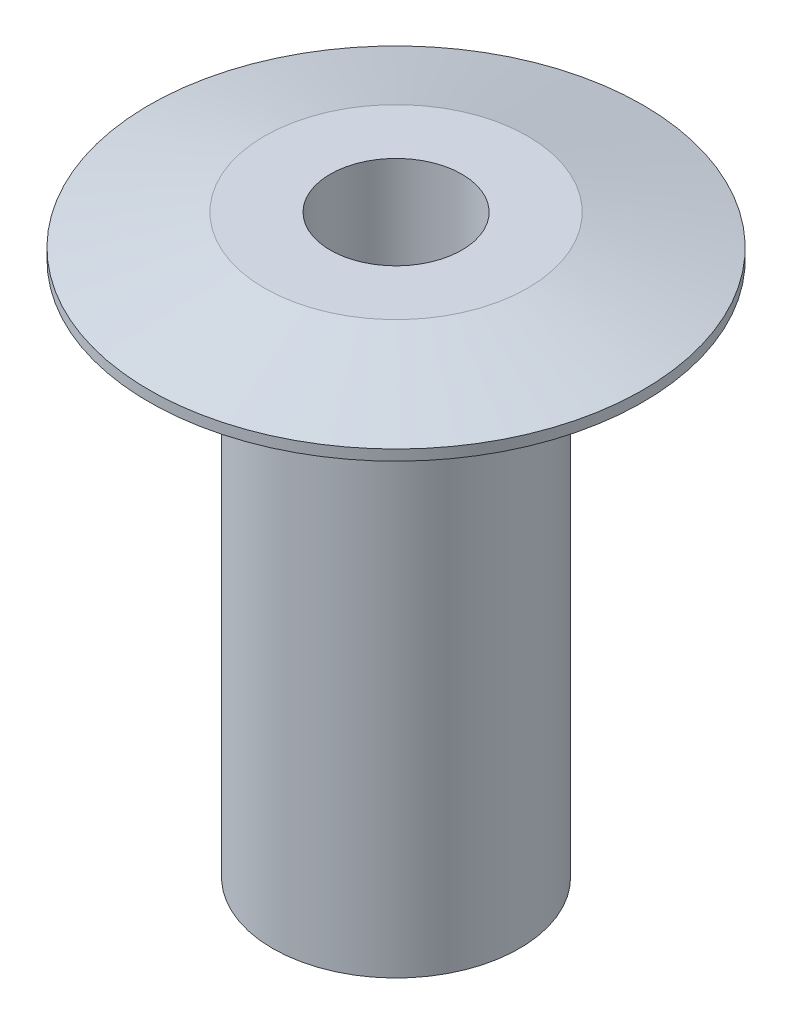
ISO-10303-21;
HEADER;
FILE_DESCRIPTION(('STEP AP214'),'2;1');
FILE_NAME('part.step','',(''),(''),'','','');
FILE_SCHEMA(('AUTOMOTIVE_DESIGN { 1 0 10303 214 1 1 1 1 }'));
ENDSEC;
DATA;
#1=APPLICATION_CONTEXT('core data for automotive mechanical design processes');
#2=APPLICATION_PROTOCOL_DEFINITION('international standard','automotive_design',2000,#1);
#3=PRODUCT_CONTEXT('',#1,'mechanical');
#4=PRODUCT('Part','Part','',(#3));
#5=PRODUCT_RELATED_PRODUCT_CATEGORY('part','',(#4));
#6=PRODUCT_DEFINITION_FORMATION('','',#4);
#7=PRODUCT_DEFINITION_CONTEXT('part definition',#1,'design');
#8=PRODUCT_DEFINITION('design','',#6,#7);
#9=PRODUCT_DEFINITION_SHAPE('','',#8);
#10=(LENGTH_UNIT() NAMED_UNIT(*) SI_UNIT(.MILLI.,.METRE.));
#11=(NAMED_UNIT(*) PLANE_ANGLE_UNIT() SI_UNIT($,.RADIAN.));
#12=(NAMED_UNIT(*) SI_UNIT($,.STERADIAN.) SOLID_ANGLE_UNIT());
#13=UNCERTAINTY_MEASURE_WITH_UNIT(LENGTH_MEASURE(1.E-05),#10,'distance_accuracy_value','');
#14=(GEOMETRIC_REPRESENTATION_CONTEXT(3) GLOBAL_UNCERTAINTY_ASSIGNED_CONTEXT((#13)) GLOBAL_UNIT_ASSIGNED_CONTEXT((#10,
#11,#12)) REPRESENTATION_CONTEXT('',''));
#15=CARTESIAN_POINT('',(0.,0.,0.));
#16=DIRECTION('',(0.,0.,1.));
#17=DIRECTION('',(1.,0.,0.));
#18=AXIS2_PLACEMENT_3D('',#15,#16,#17);
#19=CARTESIAN_POINT('',(0.,10.5219500000544,0.));
#20=DIRECTION('',(0.,-1.,0.));
#21=DIRECTION('',(0.,0.,-1.));
#22=AXIS2_PLACEMENT_3D('',#19,#20,#21);
#23=CONICAL_SURFACE('',#22,4.76249999974243,1.31108329803078);
#24=CARTESIAN_POINT('',(0.,11.1124999999639,0.));
#25=DIRECTION('',(0.,-1.,0.));
#26=DIRECTION('',(0.,0.,-1.));
#27=AXIS2_PLACEMENT_3D('',#24,#25,#26);
#28=CIRCLE('',#27,2.54000000006727);
#29=CARTESIAN_POINT('',(0.,11.1124999999639,-2.54000000006727));
#30=VERTEX_POINT('',#29);
#31=EDGE_CURVE('E18',#30,#30,#28,.F.);
#32=ORIENTED_EDGE('',*,*,#31,.F.);
#33=EDGE_LOOP('',(#32));
#34=FACE_BOUND('',#33,.T.);
#35=CARTESIAN_POINT('',(0.,10.5219499999993,0.));
#36=DIRECTION('',(0.,-1.,0.));
#37=DIRECTION('',(0.,0.,-1.));
#38=AXIS2_PLACEMENT_3D('',#35,#36,#37);
#39=CIRCLE('',#38,4.76250000000003);
#40=CARTESIAN_POINT('',(0.,10.5219499999993,-4.7625));
#41=VERTEX_POINT('',#40);
#42=EDGE_CURVE('E30',#41,#41,#39,.T.);
#43=ORIENTED_EDGE('',*,*,#42,.F.);
#44=EDGE_LOOP('',(#43));
#45=FACE_BOUND('',#44,.T.);
#46=ADVANCED_FACE('F15',(#34,#45),#23,.T.);
#47=CARTESIAN_POINT('',(1.26999999999988,11.1124999999994,0.));
#48=DIRECTION('',(0.,1.,0.));
#49=DIRECTION('',(0.,0.,1.));
#50=AXIS2_PLACEMENT_3D('',#47,#48,#49);
#51=PLANE('',#50);
#52=ORIENTED_EDGE('',*,*,#31,.T.);
#53=EDGE_LOOP('',(#52));
#54=FACE_BOUND('',#53,.T.);
#55=CARTESIAN_POINT('',(0.,11.1124999999994,0.));
#56=DIRECTION('',(0.,-1.,0.));
#57=DIRECTION('',(0.,0.,-1.));
#58=AXIS2_PLACEMENT_3D('',#55,#56,#57);
#59=CIRCLE('',#58,1.27000000000001);
#60=CARTESIAN_POINT('',(0.,11.1124999999994,-1.26999999999998));
#61=VERTEX_POINT('',#60);
#62=EDGE_CURVE('E36',#61,#61,#59,.T.);
#63=ORIENTED_EDGE('',*,*,#62,.T.);
#64=EDGE_LOOP('',(#63));
#65=FACE_BOUND('',#64,.T.);
#66=ADVANCED_FACE('F46',(#54,#65),#51,.T.);
#67=CARTESIAN_POINT('',(0.,0.,0.));
#68=DIRECTION('',(0.,-1.,0.));
#69=DIRECTION('',(0.,0.,-1.));
#70=AXIS2_PLACEMENT_3D('',#67,#68,#69);
#71=CYLINDRICAL_SURFACE('',#70,4.76250000000003);
#72=ORIENTED_EDGE('',*,*,#42,.T.);
#73=EDGE_LOOP('',(#72));
#74=FACE_BOUND('',#73,.T.);
#75=CARTESIAN_POINT('',(0.,10.3187499999997,0.));
#76=DIRECTION('',(0.,-1.,0.));
#77=DIRECTION('',(0.,0.,-1.));
#78=AXIS2_PLACEMENT_3D('',#75,#76,#77);
#79=CIRCLE('',#78,4.76250000000003);
#80=CARTESIAN_POINT('',(0.,10.3187499999997,-4.7625));
#81=VERTEX_POINT('',#80);
#82=EDGE_CURVE('E34',#81,#81,#79,.T.);
#83=ORIENTED_EDGE('',*,*,#82,.F.);
#84=EDGE_LOOP('',(#83));
#85=FACE_BOUND('',#84,.T.);
#86=ADVANCED_FACE('F54',(#74,#85),#71,.T.);
#87=CARTESIAN_POINT('',(0.,0.,0.));
#88=DIRECTION('',(0.,-1.,0.));
#89=DIRECTION('',(0.,0.,-1.));
#90=AXIS2_PLACEMENT_3D('',#87,#88,#89);
#91=CYLINDRICAL_SURFACE('',#90,1.27000000000001);
#92=CARTESIAN_POINT('',(0.,0.,0.));
#93=DIRECTION('',(0.,-1.,0.));
#94=DIRECTION('',(0.,0.,-1.));
#95=AXIS2_PLACEMENT_3D('',#92,#93,#94);
#96=CIRCLE('',#95,1.27000000000001);
#97=CARTESIAN_POINT('',(0.,0.,-1.27000000000001));
#98=VERTEX_POINT('',#97);
#99=EDGE_CURVE('E27',#98,#98,#96,.F.);
#100=ORIENTED_EDGE('',*,*,#99,.F.);
#101=EDGE_LOOP('',(#100));
#102=FACE_BOUND('',#101,.T.);
#103=ORIENTED_EDGE('',*,*,#62,.F.);
#104=EDGE_LOOP('',(#103));
#105=FACE_BOUND('',#104,.T.);
#106=ADVANCED_FACE('F69',(#102,#105),#91,.F.);
#107=CARTESIAN_POINT('',(4.7625,10.3187499999997,-8.88178419700125E-13));
#108=DIRECTION('',(0.,-1.,0.));
#109=DIRECTION('',(0.,0.,-1.));
#110=AXIS2_PLACEMENT_3D('',#107,#108,#109);
#111=PLANE('',#110);
#112=CARTESIAN_POINT('',(0.,10.3187499999997,0.));
#113=DIRECTION('',(0.,-1.,0.));
#114=DIRECTION('',(0.,0.,-1.));
#115=AXIS2_PLACEMENT_3D('',#112,#113,#114);
#116=CIRCLE('',#115,2.38125000000001);
#117=CARTESIAN_POINT('',(0.,10.3187499999997,-2.38124999999998));
#118=VERTEX_POINT('',#117);
#119=EDGE_CURVE('E22',#118,#118,#116,.T.);
#120=ORIENTED_EDGE('',*,*,#119,.F.);
#121=EDGE_LOOP('',(#120));
#122=FACE_BOUND('',#121,.T.);
#123=ORIENTED_EDGE('',*,*,#82,.T.);
#124=EDGE_LOOP('',(#123));
#125=FACE_BOUND('',#124,.T.);
#126=ADVANCED_FACE('F63',(#122,#125),#111,.T.);
#127=CARTESIAN_POINT('',(2.38124999999911,0.,0.));
#128=DIRECTION('',(0.,-1.,0.));
#129=DIRECTION('',(0.,0.,-1.));
#130=AXIS2_PLACEMENT_3D('',#127,#128,#129);
#131=PLANE('',#130);
#132=ORIENTED_EDGE('',*,*,#99,.T.);
#133=EDGE_LOOP('',(#132));
#134=FACE_BOUND('',#133,.T.);
#135=CARTESIAN_POINT('',(0.,0.,0.));
#136=DIRECTION('',(0.,-1.,0.));
#137=DIRECTION('',(0.,0.,-1.));
#138=AXIS2_PLACEMENT_3D('',#135,#136,#137);
#139=CIRCLE('',#138,2.38125000000001);
#140=CARTESIAN_POINT('',(0.,0.,-2.38125000000001));
#141=VERTEX_POINT('',#140);
#142=EDGE_CURVE('E10',#141,#141,#139,.F.);
#143=ORIENTED_EDGE('',*,*,#142,.F.);
#144=EDGE_LOOP('',(#143));
#145=FACE_BOUND('',#144,.T.);
#146=ADVANCED_FACE('F57',(#134,#145),#131,.T.);
#147=CARTESIAN_POINT('',(0.,0.,0.));
#148=DIRECTION('',(0.,-1.,0.));
#149=DIRECTION('',(0.,0.,-1.));
#150=AXIS2_PLACEMENT_3D('',#147,#148,#149);
#151=CYLINDRICAL_SURFACE('',#150,2.38125000000001);
#152=ORIENTED_EDGE('',*,*,#119,.T.);
#153=EDGE_LOOP('',(#152));
#154=FACE_BOUND('',#153,.T.);
#155=ORIENTED_EDGE('',*,*,#142,.T.);
#156=EDGE_LOOP('',(#155));
#157=FACE_BOUND('',#156,.T.);
#158=ADVANCED_FACE('F55',(#154,#157),#151,.T.);
#159=CLOSED_SHELL('',(#46,#66,#86,#106,#126,#146,#158));
#160=MANIFOLD_SOLID_BREP('B1',#159);
#161=ADVANCED_BREP_SHAPE_REPRESENTATION('',(#18,#160),#14);
#162=SHAPE_DEFINITION_REPRESENTATION(#9,#161);
ENDSEC;
END-ISO-10303-21;
